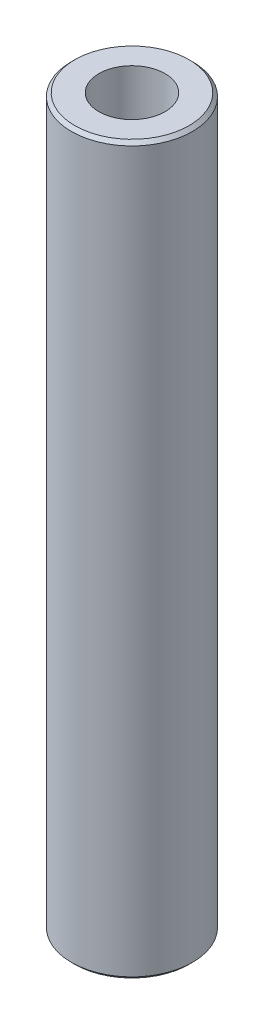
ISO-10303-21;
HEADER;
FILE_DESCRIPTION(('STEP AP214'),'2;1');
FILE_NAME('part.step','',(''),(''),'','','');
FILE_SCHEMA(('AUTOMOTIVE_DESIGN { 1 0 10303 214 1 1 1 1 }'));
ENDSEC;
DATA;
#1=APPLICATION_CONTEXT('core data for automotive mechanical design processes');
#2=APPLICATION_PROTOCOL_DEFINITION('international standard','automotive_design',2000,#1);
#3=PRODUCT_CONTEXT('',#1,'mechanical');
#4=PRODUCT('Part','Part','',(#3));
#5=PRODUCT_RELATED_PRODUCT_CATEGORY('part','',(#4));
#6=PRODUCT_DEFINITION_FORMATION('','',#4);
#7=PRODUCT_DEFINITION_CONTEXT('part definition',#1,'design');
#8=PRODUCT_DEFINITION('design','',#6,#7);
#9=PRODUCT_DEFINITION_SHAPE('','',#8);
#10=(LENGTH_UNIT() NAMED_UNIT(*) SI_UNIT(.MILLI.,.METRE.));
#11=(NAMED_UNIT(*) PLANE_ANGLE_UNIT() SI_UNIT($,.RADIAN.));
#12=(NAMED_UNIT(*) SI_UNIT($,.STERADIAN.) SOLID_ANGLE_UNIT());
#13=UNCERTAINTY_MEASURE_WITH_UNIT(LENGTH_MEASURE(1.E-05),#10,'distance_accuracy_value','');
#14=(GEOMETRIC_REPRESENTATION_CONTEXT(3) GLOBAL_UNCERTAINTY_ASSIGNED_CONTEXT((#13)) GLOBAL_UNIT_ASSIGNED_CONTEXT((#10,
#11,#12)) REPRESENTATION_CONTEXT('',''));
#15=CARTESIAN_POINT('',(0.,0.,0.));
#16=DIRECTION('',(0.,0.,1.));
#17=DIRECTION('',(1.,0.,0.));
#18=AXIS2_PLACEMENT_3D('',#15,#16,#17);
#19=CARTESIAN_POINT('',(0.,600.,0.));
#20=DIRECTION('',(0.,-1.,0.));
#21=DIRECTION('',(0.,0.,-1.));
#22=AXIS2_PLACEMENT_3D('',#19,#20,#21);
#23=CYLINDRICAL_SURFACE('',#22,50.);
#24=CARTESIAN_POINT('',(0.,597.2070049045,0.));
#25=DIRECTION('',(0.,1.,0.));
#26=DIRECTION('',(0.,0.,1.));
#27=AXIS2_PLACEMENT_3D('',#24,#25,#26);
#28=CIRCLE('',#27,50.);
#29=CARTESIAN_POINT('',(0.,597.2070049045,50.));
#30=VERTEX_POINT('',#29);
#31=EDGE_CURVE('E50',#30,#30,#28,.F.);
#32=ORIENTED_EDGE('',*,*,#31,.T.);
#33=EDGE_LOOP('',(#32));
#34=FACE_BOUND('',#33,.T.);
#35=CARTESIAN_POINT('',(0.,2.79299509549991,0.));
#36=DIRECTION('',(0.,1.,0.));
#37=DIRECTION('',(0.,0.,1.));
#38=AXIS2_PLACEMENT_3D('',#35,#36,#37);
#39=CIRCLE('',#38,50.);
#40=CARTESIAN_POINT('',(0.,2.79299509549991,50.));
#41=VERTEX_POINT('',#40);
#42=EDGE_CURVE('E51',#41,#41,#39,.T.);
#43=ORIENTED_EDGE('',*,*,#42,.T.);
#44=EDGE_LOOP('',(#43));
#45=FACE_BOUND('',#44,.T.);
#46=ADVANCED_FACE('F39',(#34,#45),#23,.T.);
#47=CARTESIAN_POINT('',(0.,600.,0.));
#48=DIRECTION('',(0.,1.,0.));
#49=DIRECTION('',(0.,0.,1.));
#50=AXIS2_PLACEMENT_3D('',#47,#48,#49);
#51=PLANE('',#50);
#52=CARTESIAN_POINT('',(0.,600.,0.));
#53=DIRECTION('',(0.,1.,0.));
#54=DIRECTION('',(0.,0.,1.));
#55=AXIS2_PLACEMENT_3D('',#52,#53,#54);
#56=CIRCLE('',#55,47.2070049044999);
#57=CARTESIAN_POINT('',(0.,600.,47.2070049044999));
#58=VERTEX_POINT('',#57);
#59=EDGE_CURVE('E54',#58,#58,#56,.T.);
#60=ORIENTED_EDGE('',*,*,#59,.T.);
#61=EDGE_LOOP('',(#60));
#62=FACE_BOUND('',#61,.T.);
#63=CARTESIAN_POINT('',(0.,600.,0.));
#64=DIRECTION('',(0.,1.,0.));
#65=DIRECTION('',(0.,0.,1.));
#66=AXIS2_PLACEMENT_3D('',#63,#64,#65);
#67=CIRCLE('',#66,27.3052392671628);
#68=CARTESIAN_POINT('',(0.,600.,27.3052392671628));
#69=VERTEX_POINT('',#68);
#70=EDGE_CURVE('E58',#69,#69,#67,.T.);
#71=ORIENTED_EDGE('',*,*,#70,.F.);
#72=EDGE_LOOP('',(#71));
#73=FACE_BOUND('',#72,.T.);
#74=ADVANCED_FACE('F69',(#62,#73),#51,.T.);
#75=CARTESIAN_POINT('',(0.,0.,0.));
#76=DIRECTION('',(0.,1.,0.));
#77=DIRECTION('',(0.,0.,1.));
#78=AXIS2_PLACEMENT_3D('',#75,#76,#77);
#79=PLANE('',#78);
#80=CARTESIAN_POINT('',(0.,0.,0.));
#81=DIRECTION('',(0.,1.,0.));
#82=DIRECTION('',(0.,0.,1.));
#83=AXIS2_PLACEMENT_3D('',#80,#81,#82);
#84=CIRCLE('',#83,47.2070049045001);
#85=CARTESIAN_POINT('',(0.,0.,47.2070049045001));
#86=VERTEX_POINT('',#85);
#87=EDGE_CURVE('E10',#86,#86,#84,.F.);
#88=ORIENTED_EDGE('',*,*,#87,.T.);
#89=EDGE_LOOP('',(#88));
#90=FACE_BOUND('',#89,.T.);
#91=CARTESIAN_POINT('',(0.,0.,0.));
#92=DIRECTION('',(0.,1.,0.));
#93=DIRECTION('',(0.,0.,1.));
#94=AXIS2_PLACEMENT_3D('',#91,#92,#93);
#95=CIRCLE('',#94,27.3052392671628);
#96=CARTESIAN_POINT('',(0.,0.,27.3052392671628));
#97=VERTEX_POINT('',#96);
#98=EDGE_CURVE('E63',#97,#97,#95,.T.);
#99=ORIENTED_EDGE('',*,*,#98,.T.);
#100=EDGE_LOOP('',(#99));
#101=FACE_BOUND('',#100,.T.);
#102=ADVANCED_FACE('F75',(#90,#101),#79,.F.);
#103=CARTESIAN_POINT('',(0.,600.,0.));
#104=DIRECTION('',(0.,-1.,0.));
#105=DIRECTION('',(0.,0.,-1.));
#106=AXIS2_PLACEMENT_3D('',#103,#104,#105);
#107=CYLINDRICAL_SURFACE('',#106,27.3052392671628);
#108=ORIENTED_EDGE('',*,*,#70,.T.);
#109=EDGE_LOOP('',(#108));
#110=FACE_BOUND('',#109,.T.);
#111=ORIENTED_EDGE('',*,*,#98,.F.);
#112=EDGE_LOOP('',(#111));
#113=FACE_BOUND('',#112,.T.);
#114=ADVANCED_FACE('F70',(#110,#113),#107,.F.);
#115=CARTESIAN_POINT('',(0.,600.,0.));
#116=DIRECTION('',(0.,-1.,0.));
#117=DIRECTION('',(0.,0.,-1.));
#118=AXIS2_PLACEMENT_3D('',#115,#116,#117);
#119=CONICAL_SURFACE('',#118,47.2070049044999,0.785398163397461);
#120=ORIENTED_EDGE('',*,*,#31,.F.);
#121=EDGE_LOOP('',(#120));
#122=FACE_BOUND('',#121,.T.);
#123=ORIENTED_EDGE('',*,*,#59,.F.);
#124=EDGE_LOOP('',(#123));
#125=FACE_BOUND('',#124,.T.);
#126=ADVANCED_FACE('F81',(#122,#125),#119,.T.);
#127=CARTESIAN_POINT('',(0.,2.79299509549991,0.));
#128=DIRECTION('',(0.,1.,0.));
#129=DIRECTION('',(0.,0.,1.));
#130=AXIS2_PLACEMENT_3D('',#127,#128,#129);
#131=CONICAL_SURFACE('',#130,50.,0.78539816339745);
#132=ORIENTED_EDGE('',*,*,#87,.F.);
#133=EDGE_LOOP('',(#132));
#134=FACE_BOUND('',#133,.T.);
#135=ORIENTED_EDGE('',*,*,#42,.F.);
#136=EDGE_LOOP('',(#135));
#137=FACE_BOUND('',#136,.T.);
#138=ADVANCED_FACE('F45',(#134,#137),#131,.T.);
#139=CLOSED_SHELL('',(#46,#74,#102,#114,#126,#138));
#140=MANIFOLD_SOLID_BREP('B2',#139);
#141=ADVANCED_BREP_SHAPE_REPRESENTATION('',(#18,#140),#14);
#142=SHAPE_DEFINITION_REPRESENTATION(#9,#141);
ENDSEC;
END-ISO-10303-21;
